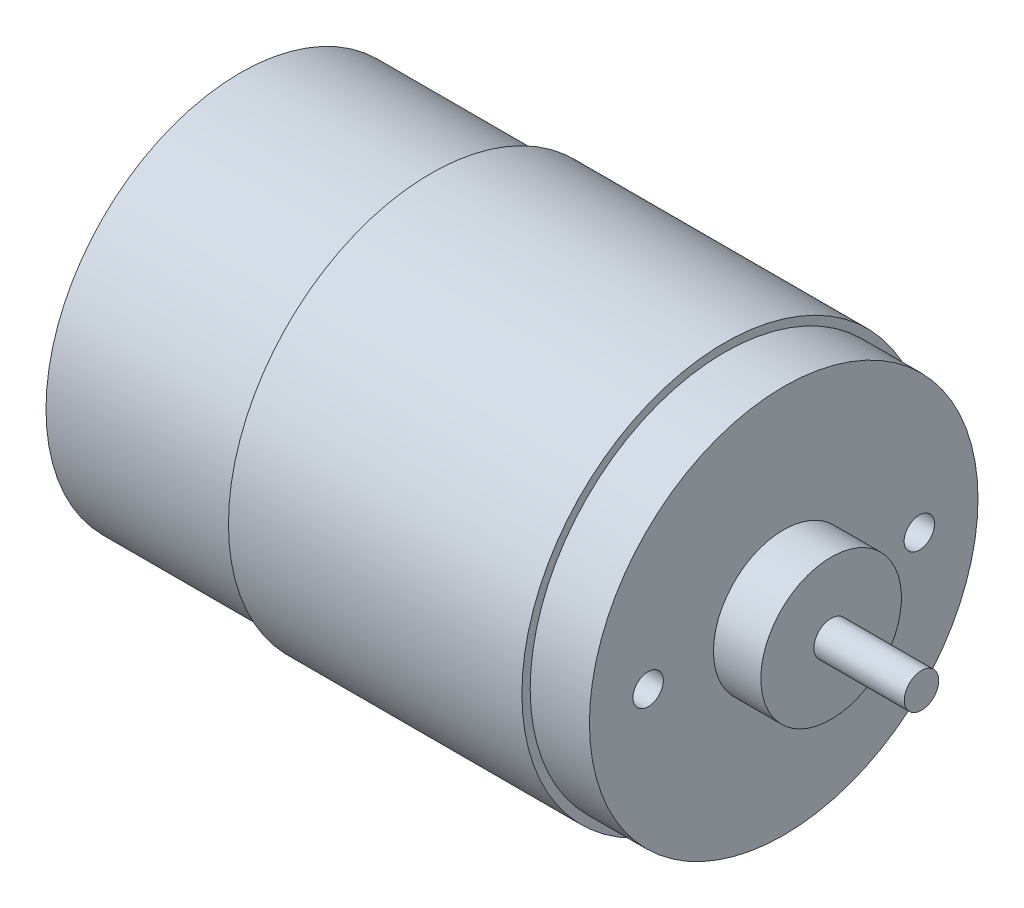
ISO-10303-21;
HEADER;
FILE_DESCRIPTION(('STEP AP214'),'2;1');
FILE_NAME('part.step','',(''),(''),'','','');
FILE_SCHEMA(('AUTOMOTIVE_DESIGN { 1 0 10303 214 1 1 1 1 }'));
ENDSEC;
DATA;
#1=APPLICATION_CONTEXT('core data for automotive mechanical design processes');
#2=APPLICATION_PROTOCOL_DEFINITION('international standard','automotive_design',2000,#1);
#3=PRODUCT_CONTEXT('',#1,'mechanical');
#4=PRODUCT('Part','Part','',(#3));
#5=PRODUCT_RELATED_PRODUCT_CATEGORY('part','',(#4));
#6=PRODUCT_DEFINITION_FORMATION('','',#4);
#7=PRODUCT_DEFINITION_CONTEXT('part definition',#1,'design');
#8=PRODUCT_DEFINITION('design','',#6,#7);
#9=PRODUCT_DEFINITION_SHAPE('','',#8);
#10=(LENGTH_UNIT() NAMED_UNIT(*) SI_UNIT(.MILLI.,.METRE.));
#11=(NAMED_UNIT(*) PLANE_ANGLE_UNIT() SI_UNIT($,.RADIAN.));
#12=(NAMED_UNIT(*) SI_UNIT($,.STERADIAN.) SOLID_ANGLE_UNIT());
#13=UNCERTAINTY_MEASURE_WITH_UNIT(LENGTH_MEASURE(1.E-05),#10,'distance_accuracy_value','');
#14=(GEOMETRIC_REPRESENTATION_CONTEXT(3) GLOBAL_UNCERTAINTY_ASSIGNED_CONTEXT((#13)) GLOBAL_UNIT_ASSIGNED_CONTEXT((#10,
#11,#12)) REPRESENTATION_CONTEXT('',''));
#15=CARTESIAN_POINT('',(0.,0.,0.));
#16=DIRECTION('',(0.,0.,1.));
#17=DIRECTION('',(1.,0.,0.));
#18=AXIS2_PLACEMENT_3D('',#15,#16,#17);
#19=CARTESIAN_POINT('',(-29.8040836820084,0.,0.));
#20=DIRECTION('',(1.,0.,0.));
#21=DIRECTION('',(0.,0.,-1.));
#22=AXIS2_PLACEMENT_3D('',#19,#20,#21);
#23=PLANE('',#22);
#24=CARTESIAN_POINT('',(-29.8040836820084,0.,0.));
#25=DIRECTION('',(-1.,0.,0.));
#26=DIRECTION('',(0.,0.,1.));
#27=AXIS2_PLACEMENT_3D('',#24,#25,#26);
#28=CIRCLE('',#27,1.53462761506276);
#29=CARTESIAN_POINT('',(-29.8040836820084,0.,1.53462761506276));
#30=VERTEX_POINT('',#29);
#31=EDGE_CURVE('E12',#30,#30,#28,.T.);
#32=ORIENTED_EDGE('',*,*,#31,.T.);
#33=EDGE_LOOP('',(#32));
#34=FACE_BOUND('',#33,.T.);
#35=ADVANCED_FACE('F44',(#34),#23,.F.);
#36=CARTESIAN_POINT('',(-37.6387615062761,0.,0.));
#37=DIRECTION('',(-1.,0.,0.));
#38=DIRECTION('',(0.,0.,1.));
#39=AXIS2_PLACEMENT_3D('',#36,#37,#38);
#40=CYLINDRICAL_SURFACE('',#39,1.53462761506276);
#41=ORIENTED_EDGE('',*,*,#31,.F.);
#42=EDGE_LOOP('',(#41));
#43=FACE_BOUND('',#42,.T.);
#44=CARTESIAN_POINT('',(-28.9156150627615,0.,0.));
#45=DIRECTION('',(-1.,0.,0.));
#46=DIRECTION('',(0.,0.,1.));
#47=AXIS2_PLACEMENT_3D('',#44,#45,#46);
#48=CIRCLE('',#47,1.53462761506276);
#49=CARTESIAN_POINT('',(-28.9156150627615,0.,1.53462761506276));
#50=VERTEX_POINT('',#49);
#51=EDGE_CURVE('E50',#50,#50,#48,.T.);
#52=ORIENTED_EDGE('',*,*,#51,.T.);
#53=EDGE_LOOP('',(#52));
#54=FACE_BOUND('',#53,.T.);
#55=ADVANCED_FACE('F163',(#43,#54),#40,.T.);
#56=CARTESIAN_POINT('',(-28.9156150627615,1.53462761506276,0.));
#57=DIRECTION('',(1.,0.,0.));
#58=DIRECTION('',(0.,0.,-1.));
#59=AXIS2_PLACEMENT_3D('',#56,#57,#58);
#60=PLANE('',#59);
#61=ORIENTED_EDGE('',*,*,#51,.F.);
#62=EDGE_LOOP('',(#61));
#63=FACE_BOUND('',#62,.T.);
#64=CARTESIAN_POINT('',(-28.9156150627615,0.,0.));
#65=DIRECTION('',(-1.,0.,0.));
#66=DIRECTION('',(0.,0.,1.));
#67=AXIS2_PLACEMENT_3D('',#64,#65,#66);
#68=CIRCLE('',#67,2.66540585774058);
#69=CARTESIAN_POINT('',(-28.9156150627615,0.,2.66540585774058));
#70=VERTEX_POINT('',#69);
#71=EDGE_CURVE('E54',#70,#70,#68,.T.);
#72=ORIENTED_EDGE('',*,*,#71,.T.);
#73=EDGE_LOOP('',(#72));
#74=FACE_BOUND('',#73,.T.);
#75=ADVANCED_FACE('F167',(#63,#74),#60,.F.);
#76=CARTESIAN_POINT('',(-37.6387615062761,0.,0.));
#77=DIRECTION('',(-1.,0.,0.));
#78=DIRECTION('',(0.,0.,1.));
#79=AXIS2_PLACEMENT_3D('',#76,#77,#78);
#80=CYLINDRICAL_SURFACE('',#79,2.66540585774058);
#81=ORIENTED_EDGE('',*,*,#71,.F.);
#82=EDGE_LOOP('',(#81));
#83=FACE_BOUND('',#82,.T.);
#84=CARTESIAN_POINT('',(-27.6232970711297,0.,0.));
#85=DIRECTION('',(-1.,0.,0.));
#86=DIRECTION('',(0.,0.,1.));
#87=AXIS2_PLACEMENT_3D('',#84,#85,#86);
#88=CIRCLE('',#87,2.66540585774058);
#89=CARTESIAN_POINT('',(-27.6232970711297,0.,2.66540585774058));
#90=VERTEX_POINT('',#89);
#91=EDGE_CURVE('E58',#90,#90,#88,.T.);
#92=ORIENTED_EDGE('',*,*,#91,.T.);
#93=EDGE_LOOP('',(#92));
#94=FACE_BOUND('',#93,.T.);
#95=ADVANCED_FACE('F172',(#83,#94),#80,.T.);
#96=CARTESIAN_POINT('',(-27.6232970711297,2.66540585774058,0.));
#97=DIRECTION('',(1.,0.,0.));
#98=DIRECTION('',(0.,0.,-1.));
#99=AXIS2_PLACEMENT_3D('',#96,#97,#98);
#100=PLANE('',#99);
#101=ORIENTED_EDGE('',*,*,#91,.F.);
#102=EDGE_LOOP('',(#101));
#103=FACE_BOUND('',#102,.T.);
#104=CARTESIAN_POINT('',(-27.6232970711297,0.,0.));
#105=DIRECTION('',(-1.,0.,0.));
#106=DIRECTION('',(0.,0.,1.));
#107=AXIS2_PLACEMENT_3D('',#104,#105,#106);
#108=CIRCLE('',#107,4.76542259414226);
#109=CARTESIAN_POINT('',(-27.6232970711297,0.,4.76542259414226));
#110=VERTEX_POINT('',#109);
#111=EDGE_CURVE('E63',#110,#110,#108,.T.);
#112=ORIENTED_EDGE('',*,*,#111,.T.);
#113=EDGE_LOOP('',(#112));
#114=FACE_BOUND('',#113,.T.);
#115=ADVANCED_FACE('F178',(#103,#114),#100,.F.);
#116=CARTESIAN_POINT('',(-26.6944435146444,0.,0.));
#117=DIRECTION('',(1.,0.,0.));
#118=DIRECTION('',(0.,0.,-1.));
#119=AXIS2_PLACEMENT_3D('',#116,#117,#118);
#120=CONICAL_SURFACE('',#119,5.69427615062763,0.785398163397459);
#121=ORIENTED_EDGE('',*,*,#111,.F.);
#122=EDGE_LOOP('',(#121));
#123=FACE_BOUND('',#122,.T.);
#124=CARTESIAN_POINT('',(-26.6944435146444,0.,0.));
#125=DIRECTION('',(-1.,0.,0.));
#126=DIRECTION('',(0.,0.,1.));
#127=AXIS2_PLACEMENT_3D('',#124,#125,#126);
#128=CIRCLE('',#127,5.69427615062763);
#129=CARTESIAN_POINT('',(-26.6944435146444,0.,5.69427615062763));
#130=VERTEX_POINT('',#129);
#131=EDGE_CURVE('E66',#130,#130,#128,.T.);
#132=ORIENTED_EDGE('',*,*,#131,.T.);
#133=EDGE_LOOP('',(#132));
#134=FACE_BOUND('',#133,.T.);
#135=ADVANCED_FACE('F182',(#123,#134),#120,.T.);
#136=CARTESIAN_POINT('',(-37.6387615062761,0.,0.));
#137=DIRECTION('',(-1.,0.,0.));
#138=DIRECTION('',(0.,0.,1.));
#139=AXIS2_PLACEMENT_3D('',#136,#137,#138);
#140=CYLINDRICAL_SURFACE('',#139,5.69427615062762);
#141=ORIENTED_EDGE('',*,*,#131,.F.);
#142=EDGE_LOOP('',(#141));
#143=FACE_BOUND('',#142,.T.);
#144=CARTESIAN_POINT('',(-24.6478836820084,0.,0.));
#145=DIRECTION('',(-1.,0.,0.));
#146=DIRECTION('',(0.,0.,1.));
#147=AXIS2_PLACEMENT_3D('',#144,#145,#146);
#148=CIRCLE('',#147,5.69427615062762);
#149=CARTESIAN_POINT('',(-24.6478836820084,0.,5.69427615062762));
#150=VERTEX_POINT('',#149);
#151=EDGE_CURVE('E69',#150,#150,#148,.T.);
#152=ORIENTED_EDGE('',*,*,#151,.T.);
#153=EDGE_LOOP('',(#152));
#154=FACE_BOUND('',#153,.T.);
#155=ADVANCED_FACE('F186',(#143,#154),#140,.T.);
#156=CARTESIAN_POINT('',(-24.6478836820084,5.69427615062762,0.));
#157=DIRECTION('',(1.,0.,0.));
#158=DIRECTION('',(0.,0.,-1.));
#159=AXIS2_PLACEMENT_3D('',#156,#157,#158);
#160=PLANE('',#159);
#161=ORIENTED_EDGE('',*,*,#151,.F.);
#162=EDGE_LOOP('',(#161));
#163=FACE_BOUND('',#162,.T.);
#164=CARTESIAN_POINT('',(-24.6478836820084,0.,0.));
#165=DIRECTION('',(-1.,0.,0.));
#166=DIRECTION('',(0.,0.,1.));
#167=AXIS2_PLACEMENT_3D('',#164,#165,#166);
#168=CIRCLE('',#167,17.907);
#169=CARTESIAN_POINT('',(-24.6478836820084,0.,17.907));
#170=VERTEX_POINT('',#169);
#171=EDGE_CURVE('E72',#170,#170,#168,.T.);
#172=ORIENTED_EDGE('',*,*,#171,.T.);
#173=EDGE_LOOP('',(#172));
#174=FACE_BOUND('',#173,.T.);
#175=ADVANCED_FACE('F190',(#163,#174),#160,.F.);
#176=CARTESIAN_POINT('',(-37.6387615062761,0.,0.));
#177=DIRECTION('',(-1.,0.,0.));
#178=DIRECTION('',(0.,0.,1.));
#179=AXIS2_PLACEMENT_3D('',#176,#177,#178);
#180=CYLINDRICAL_SURFACE('',#179,17.907);
#181=ORIENTED_EDGE('',*,*,#171,.F.);
#182=EDGE_LOOP('',(#181));
#183=FACE_BOUND('',#182,.T.);
#184=CARTESIAN_POINT('',(-7.07108368200839,0.,0.));
#185=DIRECTION('',(-1.,0.,0.));
#186=DIRECTION('',(0.,0.,1.));
#187=AXIS2_PLACEMENT_3D('',#184,#185,#186);
#188=CIRCLE('',#187,17.907);
#189=CARTESIAN_POINT('',(-7.07108368200839,0.,17.907));
#190=VERTEX_POINT('',#189);
#191=EDGE_CURVE('E75',#190,#190,#188,.T.);
#192=ORIENTED_EDGE('',*,*,#191,.T.);
#193=EDGE_LOOP('',(#192));
#194=FACE_BOUND('',#193,.T.);
#195=ADVANCED_FACE('F194',(#183,#194),#180,.T.);
#196=CARTESIAN_POINT('',(-7.07108368200839,17.907,0.));
#197=DIRECTION('',(1.,0.,0.));
#198=DIRECTION('',(0.,0.,-1.));
#199=AXIS2_PLACEMENT_3D('',#196,#197,#198);
#200=PLANE('',#199);
#201=ORIENTED_EDGE('',*,*,#191,.F.);
#202=EDGE_LOOP('',(#201));
#203=FACE_BOUND('',#202,.T.);
#204=CARTESIAN_POINT('',(-7.07108368200839,0.,0.));
#205=DIRECTION('',(-1.,0.,0.));
#206=DIRECTION('',(0.,0.,1.));
#207=AXIS2_PLACEMENT_3D('',#204,#205,#206);
#208=CIRCLE('',#207,18.669);
#209=CARTESIAN_POINT('',(-7.07108368200839,0.,18.669));
#210=VERTEX_POINT('',#209);
#211=EDGE_CURVE('E78',#210,#210,#208,.T.);
#212=ORIENTED_EDGE('',*,*,#211,.T.);
#213=EDGE_LOOP('',(#212));
#214=FACE_BOUND('',#213,.T.);
#215=ADVANCED_FACE('F198',(#203,#214),#200,.F.);
#216=CARTESIAN_POINT('',(-37.6387615062761,0.,0.));
#217=DIRECTION('',(-1.,0.,0.));
#218=DIRECTION('',(0.,0.,1.));
#219=AXIS2_PLACEMENT_3D('',#216,#217,#218);
#220=CYLINDRICAL_SURFACE('',#219,18.669);
#221=ORIENTED_EDGE('',*,*,#211,.F.);
#222=EDGE_LOOP('',(#221));
#223=FACE_BOUND('',#222,.T.);
#224=CARTESIAN_POINT('',(19.9799163179916,0.,0.));
#225=DIRECTION('',(-1.,0.,0.));
#226=DIRECTION('',(0.,0.,1.));
#227=AXIS2_PLACEMENT_3D('',#224,#225,#226);
#228=CIRCLE('',#227,18.669);
#229=CARTESIAN_POINT('',(19.9799163179916,0.,18.669));
#230=VERTEX_POINT('',#229);
#231=EDGE_CURVE('E81',#230,#230,#228,.T.);
#232=ORIENTED_EDGE('',*,*,#231,.T.);
#233=EDGE_LOOP('',(#232));
#234=FACE_BOUND('',#233,.T.);
#235=ADVANCED_FACE('F202',(#223,#234),#220,.T.);
#236=CARTESIAN_POINT('',(19.9799163179916,18.669,0.));
#237=DIRECTION('',(-1.,0.,0.));
#238=DIRECTION('',(0.,0.,1.));
#239=AXIS2_PLACEMENT_3D('',#236,#237,#238);
#240=PLANE('',#239);
#241=ORIENTED_EDGE('',*,*,#231,.F.);
#242=EDGE_LOOP('',(#241));
#243=FACE_BOUND('',#242,.T.);
#244=CARTESIAN_POINT('',(19.9799163179916,0.,0.));
#245=DIRECTION('',(-1.,0.,0.));
#246=DIRECTION('',(0.,0.,1.));
#247=AXIS2_PLACEMENT_3D('',#244,#245,#246);
#248=CIRCLE('',#247,17.907);
#249=CARTESIAN_POINT('',(19.9799163179916,0.,17.907));
#250=VERTEX_POINT('',#249);
#251=EDGE_CURVE('E84',#250,#250,#248,.T.);
#252=ORIENTED_EDGE('',*,*,#251,.T.);
#253=EDGE_LOOP('',(#252));
#254=FACE_BOUND('',#253,.T.);
#255=ADVANCED_FACE('F206',(#243,#254),#240,.F.);
#256=CARTESIAN_POINT('',(-37.6387615062761,0.,0.));
#257=DIRECTION('',(-1.,0.,0.));
#258=DIRECTION('',(0.,0.,1.));
#259=AXIS2_PLACEMENT_3D('',#256,#257,#258);
#260=CYLINDRICAL_SURFACE('',#259,17.907);
#261=ORIENTED_EDGE('',*,*,#251,.F.);
#262=EDGE_LOOP('',(#261));
#263=FACE_BOUND('',#262,.T.);
#264=CARTESIAN_POINT('',(25.4409163179916,0.,0.));
#265=DIRECTION('',(-1.,0.,0.));
#266=DIRECTION('',(0.,0.,1.));
#267=AXIS2_PLACEMENT_3D('',#264,#265,#266);
#268=CIRCLE('',#267,17.907);
#269=CARTESIAN_POINT('',(25.4409163179916,0.,17.907));
#270=VERTEX_POINT('',#269);
#271=EDGE_CURVE('E87',#270,#270,#268,.T.);
#272=ORIENTED_EDGE('',*,*,#271,.T.);
#273=EDGE_LOOP('',(#272));
#274=FACE_BOUND('',#273,.T.);
#275=ADVANCED_FACE('F128',(#263,#274),#260,.T.);
#276=CARTESIAN_POINT('',(25.4409163179916,17.907,0.));
#277=DIRECTION('',(-1.,0.,0.));
#278=DIRECTION('',(0.,0.,1.));
#279=AXIS2_PLACEMENT_3D('',#276,#277,#278);
#280=PLANE('',#279);
#281=CARTESIAN_POINT('',(25.4409163179916,0.,-12.4968));
#282=DIRECTION('',(1.,0.,0.));
#283=DIRECTION('',(0.,0.,1.));
#284=AXIS2_PLACEMENT_3D('',#281,#282,#283);
#285=CIRCLE('',#284,1.4);
#286=CARTESIAN_POINT('',(25.4409163179916,0.,-11.0968));
#287=VERTEX_POINT('',#286);
#288=EDGE_CURVE('E109',#287,#287,#285,.T.);
#289=ORIENTED_EDGE('',*,*,#288,.F.);
#290=EDGE_LOOP('',(#289));
#291=FACE_BOUND('',#290,.T.);
#292=CARTESIAN_POINT('',(25.4409163179916,0.,12.4968));
#293=DIRECTION('',(1.,0.,0.));
#294=DIRECTION('',(0.,0.,-1.));
#295=AXIS2_PLACEMENT_3D('',#292,#293,#294);
#296=CIRCLE('',#295,1.4);
#297=CARTESIAN_POINT('',(25.4409163179916,0.,11.0968));
#298=VERTEX_POINT('',#297);
#299=EDGE_CURVE('E103',#298,#298,#296,.T.);
#300=ORIENTED_EDGE('',*,*,#299,.F.);
#301=EDGE_LOOP('',(#300));
#302=FACE_BOUND('',#301,.T.);
#303=ORIENTED_EDGE('',*,*,#271,.F.);
#304=EDGE_LOOP('',(#303));
#305=FACE_BOUND('',#304,.T.);
#306=CARTESIAN_POINT('',(25.4409163179916,0.,0.));
#307=DIRECTION('',(-1.,0.,0.));
#308=DIRECTION('',(0.,0.,1.));
#309=AXIS2_PLACEMENT_3D('',#306,#307,#308);
#310=CIRCLE('',#309,6.477);
#311=CARTESIAN_POINT('',(25.4409163179916,0.,6.477));
#312=VERTEX_POINT('',#311);
#313=EDGE_CURVE('E90',#312,#312,#310,.T.);
#314=ORIENTED_EDGE('',*,*,#313,.T.);
#315=EDGE_LOOP('',(#314));
#316=FACE_BOUND('',#315,.T.);
#317=ADVANCED_FACE('F124',(#291,#302,#305,#316),#280,.F.);
#318=CARTESIAN_POINT('',(-37.6387615062761,0.,0.));
#319=DIRECTION('',(-1.,0.,0.));
#320=DIRECTION('',(0.,0.,1.));
#321=AXIS2_PLACEMENT_3D('',#318,#319,#320);
#322=CYLINDRICAL_SURFACE('',#321,6.477);
#323=ORIENTED_EDGE('',*,*,#313,.F.);
#324=EDGE_LOOP('',(#323));
#325=FACE_BOUND('',#324,.T.);
#326=CARTESIAN_POINT('',(29.8097163179916,0.,0.));
#327=DIRECTION('',(-1.,0.,0.));
#328=DIRECTION('',(0.,0.,1.));
#329=AXIS2_PLACEMENT_3D('',#326,#327,#328);
#330=CIRCLE('',#329,6.477);
#331=CARTESIAN_POINT('',(29.8097163179916,0.,6.477));
#332=VERTEX_POINT('',#331);
#333=EDGE_CURVE('E93',#332,#332,#330,.T.);
#334=ORIENTED_EDGE('',*,*,#333,.T.);
#335=EDGE_LOOP('',(#334));
#336=FACE_BOUND('',#335,.T.);
#337=ADVANCED_FACE('F127',(#325,#336),#322,.T.);
#338=CARTESIAN_POINT('',(29.8097163179916,6.477,0.));
#339=DIRECTION('',(-1.,0.,0.));
#340=DIRECTION('',(0.,0.,1.));
#341=AXIS2_PLACEMENT_3D('',#338,#339,#340);
#342=PLANE('',#341);
#343=ORIENTED_EDGE('',*,*,#333,.F.);
#344=EDGE_LOOP('',(#343));
#345=FACE_BOUND('',#344,.T.);
#346=CARTESIAN_POINT('',(29.8097163179916,0.,0.));
#347=DIRECTION('',(-1.,0.,0.));
#348=DIRECTION('',(0.,0.,1.));
#349=AXIS2_PLACEMENT_3D('',#346,#347,#348);
#350=CIRCLE('',#349,1.5875);
#351=CARTESIAN_POINT('',(29.8097163179916,0.,1.5875));
#352=VERTEX_POINT('',#351);
#353=EDGE_CURVE('E96',#352,#352,#350,.T.);
#354=ORIENTED_EDGE('',*,*,#353,.T.);
#355=EDGE_LOOP('',(#354));
#356=FACE_BOUND('',#355,.T.);
#357=ADVANCED_FACE('F138',(#345,#356),#342,.F.);
#358=CARTESIAN_POINT('',(-37.6387615062761,0.,0.));
#359=DIRECTION('',(-1.,0.,0.));
#360=DIRECTION('',(0.,0.,1.));
#361=AXIS2_PLACEMENT_3D('',#358,#359,#360);
#362=CYLINDRICAL_SURFACE('',#361,1.5875);
#363=ORIENTED_EDGE('',*,*,#353,.F.);
#364=EDGE_LOOP('',(#363));
#365=FACE_BOUND('',#364,.T.);
#366=CARTESIAN_POINT('',(38.1409163179916,0.,0.));
#367=DIRECTION('',(-1.,0.,0.));
#368=DIRECTION('',(0.,0.,1.));
#369=AXIS2_PLACEMENT_3D('',#366,#367,#368);
#370=CIRCLE('',#369,1.5875);
#371=CARTESIAN_POINT('',(38.1409163179916,0.,1.5875));
#372=VERTEX_POINT('',#371);
#373=EDGE_CURVE('E99',#372,#372,#370,.T.);
#374=ORIENTED_EDGE('',*,*,#373,.T.);
#375=EDGE_LOOP('',(#374));
#376=FACE_BOUND('',#375,.T.);
#377=ADVANCED_FACE('F144',(#365,#376),#362,.T.);
#378=CARTESIAN_POINT('',(38.1409163179916,1.5875,0.));
#379=DIRECTION('',(-1.,0.,0.));
#380=DIRECTION('',(0.,0.,1.));
#381=AXIS2_PLACEMENT_3D('',#378,#379,#380);
#382=PLANE('',#381);
#383=ORIENTED_EDGE('',*,*,#373,.F.);
#384=EDGE_LOOP('',(#383));
#385=FACE_BOUND('',#384,.T.);
#386=ADVANCED_FACE('F150',(#385),#382,.F.);
#387=CARTESIAN_POINT('',(19.0909163179916,0.,12.4968));
#388=DIRECTION('',(1.,0.,0.));
#389=DIRECTION('',(0.,0.,-1.));
#390=AXIS2_PLACEMENT_3D('',#387,#388,#389);
#391=CYLINDRICAL_SURFACE('',#390,1.4);
#392=CARTESIAN_POINT('',(19.0909163179916,0.,12.4968));
#393=DIRECTION('',(1.,0.,0.));
#394=DIRECTION('',(0.,0.,-1.));
#395=AXIS2_PLACEMENT_3D('',#392,#393,#394);
#396=CIRCLE('',#395,1.4);
#397=CARTESIAN_POINT('',(19.0909163179916,0.,11.0968));
#398=VERTEX_POINT('',#397);
#399=EDGE_CURVE('E102',#398,#398,#396,.T.);
#400=ORIENTED_EDGE('',*,*,#399,.F.);
#401=EDGE_LOOP('',(#400));
#402=FACE_BOUND('',#401,.T.);
#403=ORIENTED_EDGE('',*,*,#299,.T.);
#404=EDGE_LOOP('',(#403));
#405=FACE_BOUND('',#404,.T.);
#406=ADVANCED_FACE('F155',(#402,#405),#391,.F.);
#407=CARTESIAN_POINT('',(19.0909163179916,0.,12.4968));
#408=DIRECTION('',(1.,0.,0.));
#409=DIRECTION('',(0.,0.,-1.));
#410=AXIS2_PLACEMENT_3D('',#407,#408,#409);
#411=PLANE('',#410);
#412=ORIENTED_EDGE('',*,*,#399,.T.);
#413=EDGE_LOOP('',(#412));
#414=FACE_BOUND('',#413,.T.);
#415=ADVANCED_FACE('F120',(#414),#411,.T.);
#416=CARTESIAN_POINT('',(19.0909163179916,0.,-12.4968));
#417=DIRECTION('',(1.,0.,0.));
#418=DIRECTION('',(0.,0.,-1.));
#419=AXIS2_PLACEMENT_3D('',#416,#417,#418);
#420=CYLINDRICAL_SURFACE('',#419,1.4);
#421=CARTESIAN_POINT('',(19.0909163179916,0.,-12.4968));
#422=DIRECTION('',(1.,0.,0.));
#423=DIRECTION('',(0.,0.,1.));
#424=AXIS2_PLACEMENT_3D('',#421,#422,#423);
#425=CIRCLE('',#424,1.4);
#426=CARTESIAN_POINT('',(19.0909163179916,0.,-11.0968));
#427=VERTEX_POINT('',#426);
#428=EDGE_CURVE('E106',#427,#427,#425,.T.);
#429=ORIENTED_EDGE('',*,*,#428,.F.);
#430=EDGE_LOOP('',(#429));
#431=FACE_BOUND('',#430,.T.);
#432=ORIENTED_EDGE('',*,*,#288,.T.);
#433=EDGE_LOOP('',(#432));
#434=FACE_BOUND('',#433,.T.);
#435=ADVANCED_FACE('F117',(#431,#434),#420,.F.);
#436=CARTESIAN_POINT('',(19.0909163179916,0.,-12.4968));
#437=DIRECTION('',(-1.,0.,0.));
#438=DIRECTION('',(0.,0.,1.));
#439=AXIS2_PLACEMENT_3D('',#436,#437,#438);
#440=PLANE('',#439);
#441=ORIENTED_EDGE('',*,*,#428,.T.);
#442=EDGE_LOOP('',(#441));
#443=FACE_BOUND('',#442,.T.);
#444=ADVANCED_FACE('F115',(#443),#440,.F.);
#445=CLOSED_SHELL('',(#35,#55,#75,#95,#115,#135,#155,#175,#195,#215,#235,#255,#275,#317,#337,
#357,#377,#386,#406,#415,#435,#444));
#446=MANIFOLD_SOLID_BREP('B2',#445);
#447=ADVANCED_BREP_SHAPE_REPRESENTATION('',(#18,#446),#14);
#448=SHAPE_DEFINITION_REPRESENTATION(#9,#447);
ENDSEC;
END-ISO-10303-21;
